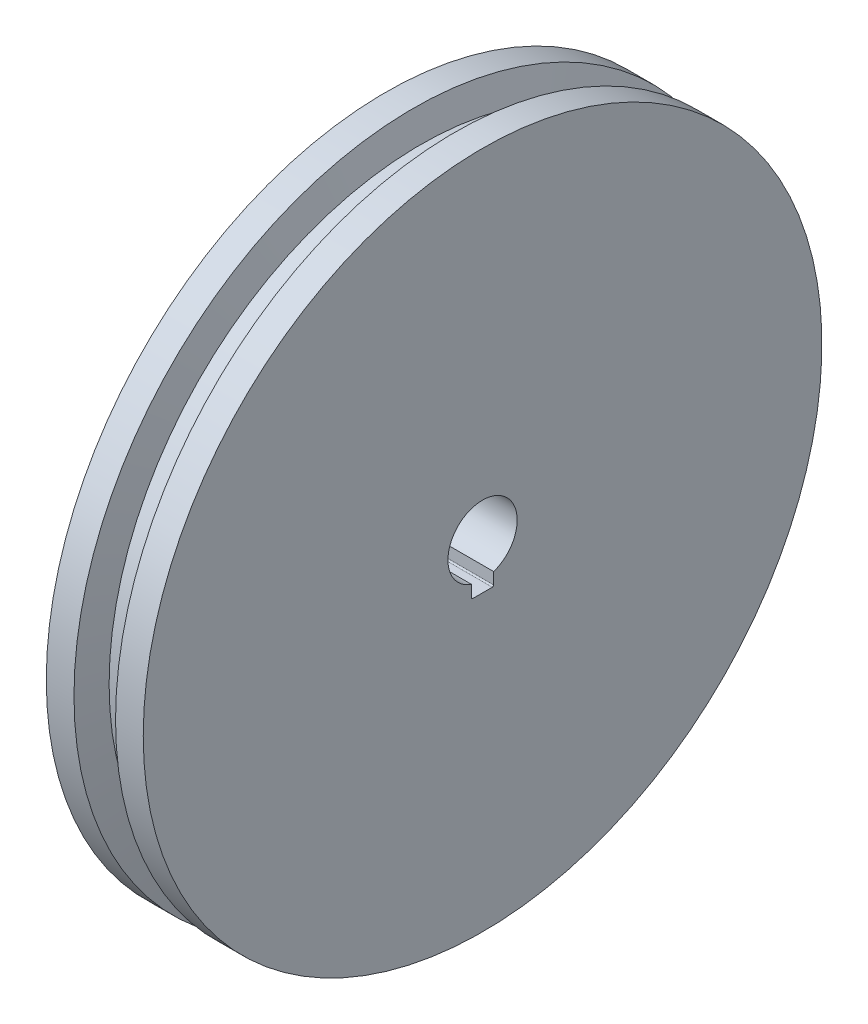
ISO-10303-21;
HEADER;
FILE_DESCRIPTION(('STEP AP214'),'2;1');
FILE_NAME('part.step','',(''),(''),'','','');
FILE_SCHEMA(('AUTOMOTIVE_DESIGN { 1 0 10303 214 1 1 1 1 }'));
ENDSEC;
DATA;
#1=APPLICATION_CONTEXT('core data for automotive mechanical design processes');
#2=APPLICATION_PROTOCOL_DEFINITION('international standard','automotive_design',2000,#1);
#3=PRODUCT_CONTEXT('',#1,'mechanical');
#4=PRODUCT('Part','Part','',(#3));
#5=PRODUCT_RELATED_PRODUCT_CATEGORY('part','',(#4));
#6=PRODUCT_DEFINITION_FORMATION('','',#4);
#7=PRODUCT_DEFINITION_CONTEXT('part definition',#1,'design');
#8=PRODUCT_DEFINITION('design','',#6,#7);
#9=PRODUCT_DEFINITION_SHAPE('','',#8);
#10=(LENGTH_UNIT() NAMED_UNIT(*) SI_UNIT(.MILLI.,.METRE.));
#11=(NAMED_UNIT(*) PLANE_ANGLE_UNIT() SI_UNIT($,.RADIAN.));
#12=(NAMED_UNIT(*) SI_UNIT($,.STERADIAN.) SOLID_ANGLE_UNIT());
#13=UNCERTAINTY_MEASURE_WITH_UNIT(LENGTH_MEASURE(1.E-05),#10,'distance_accuracy_value','');
#14=(GEOMETRIC_REPRESENTATION_CONTEXT(3) GLOBAL_UNCERTAINTY_ASSIGNED_CONTEXT((#13)) GLOBAL_UNIT_ASSIGNED_CONTEXT((#10,
#11,#12)) REPRESENTATION_CONTEXT('',''));
#15=CARTESIAN_POINT('',(0.,0.,0.));
#16=DIRECTION('',(0.,0.,1.));
#17=DIRECTION('',(1.,0.,0.));
#18=AXIS2_PLACEMENT_3D('',#15,#16,#17);
#19=CARTESIAN_POINT('',(57.3205080756888,0.,0.));
#20=DIRECTION('',(1.,0.,0.));
#21=DIRECTION('',(0.,0.,-1.));
#22=AXIS2_PLACEMENT_3D('',#19,#20,#21);
#23=CONICAL_SURFACE('',#22,112.5,1.30899693899575);
#24=CARTESIAN_POINT('',(60.,0.,0.));
#25=DIRECTION('',(-1.,0.,0.));
#26=DIRECTION('',(0.,0.,1.));
#27=AXIS2_PLACEMENT_3D('',#24,#25,#26);
#28=CIRCLE('',#27,122.5);
#29=CARTESIAN_POINT('',(60.,0.,122.5));
#30=VERTEX_POINT('',#29);
#31=EDGE_CURVE('E51',#30,#30,#28,.T.);
#32=ORIENTED_EDGE('',*,*,#31,.T.);
#33=EDGE_LOOP('',(#32));
#34=FACE_BOUND('',#33,.T.);
#35=CARTESIAN_POINT('',(57.3205080756888,0.,0.));
#36=DIRECTION('',(-1.,0.,0.));
#37=DIRECTION('',(0.,0.,1.));
#38=AXIS2_PLACEMENT_3D('',#35,#36,#37);
#39=CIRCLE('',#38,112.5);
#40=CARTESIAN_POINT('',(57.3205080756888,0.,112.5));
#41=VERTEX_POINT('',#40);
#42=EDGE_CURVE('E139',#41,#41,#39,.T.);
#43=ORIENTED_EDGE('',*,*,#42,.F.);
#44=EDGE_LOOP('',(#43));
#45=FACE_BOUND('',#44,.T.);
#46=ADVANCED_FACE('F44',(#34,#45),#23,.T.);
#47=CARTESIAN_POINT('',(0.,0.,0.));
#48=DIRECTION('',(-1.,0.,0.));
#49=DIRECTION('',(0.,0.,1.));
#50=AXIS2_PLACEMENT_3D('',#47,#48,#49);
#51=CYLINDRICAL_SURFACE('',#50,122.5);
#52=CARTESIAN_POINT('',(70.,0.,0.));
#53=DIRECTION('',(-1.,0.,0.));
#54=DIRECTION('',(0.,0.,1.));
#55=AXIS2_PLACEMENT_3D('',#52,#53,#54);
#56=CIRCLE('',#55,122.5);
#57=CARTESIAN_POINT('',(70.,0.,122.5));
#58=VERTEX_POINT('',#57);
#59=EDGE_CURVE('E173',#58,#58,#56,.T.);
#60=ORIENTED_EDGE('',*,*,#59,.T.);
#61=EDGE_LOOP('',(#60));
#62=FACE_BOUND('',#61,.T.);
#63=ORIENTED_EDGE('',*,*,#31,.F.);
#64=EDGE_LOOP('',(#63));
#65=FACE_BOUND('',#64,.T.);
#66=ADVANCED_FACE('F180',(#62,#65),#51,.T.);
#67=CARTESIAN_POINT('',(70.,-122.5,0.));
#68=DIRECTION('',(1.,0.,0.));
#69=DIRECTION('',(0.,0.,-1.));
#70=AXIS2_PLACEMENT_3D('',#67,#68,#69);
#71=PLANE('',#70);
#72=DIRECTION('',(0.,-1.,0.));
#73=VECTOR('',#72,1.);
#74=CARTESIAN_POINT('',(70.,-16.,-4.));
#75=LINE('',#74,#73);
#76=CARTESIAN_POINT('',(70.,-11.842719282327,-4.));
#77=VERTEX_POINT('',#76);
#78=CARTESIAN_POINT('',(70.,-16.,-4.));
#79=VERTEX_POINT('',#78);
#80=EDGE_CURVE('E64',#77,#79,#75,.T.);
#81=ORIENTED_EDGE('',*,*,#80,.T.);
#82=CARTESIAN_POINT('',(70.,-16.,-3.5));
#83=DIRECTION('',(-1.,0.,0.));
#84=DIRECTION('',(0.,0.,-1.));
#85=AXIS2_PLACEMENT_3D('',#82,#83,#84);
#86=CIRCLE('',#85,0.5);
#87=CARTESIAN_POINT('',(70.,-16.5,-3.49999999999999));
#88=VERTEX_POINT('',#87);
#89=EDGE_CURVE('E100',#79,#88,#86,.T.);
#90=ORIENTED_EDGE('',*,*,#89,.T.);
#91=DIRECTION('',(0.,0.,1.));
#92=VECTOR('',#91,1.);
#93=CARTESIAN_POINT('',(70.,-16.5,3.5));
#94=LINE('',#93,#92);
#95=CARTESIAN_POINT('',(70.,-16.5,3.5));
#96=VERTEX_POINT('',#95);
#97=EDGE_CURVE('E105',#88,#96,#94,.T.);
#98=ORIENTED_EDGE('',*,*,#97,.T.);
#99=CARTESIAN_POINT('',(70.,-16.,3.5));
#100=DIRECTION('',(-1.,0.,0.));
#101=DIRECTION('',(0.,0.,1.));
#102=AXIS2_PLACEMENT_3D('',#99,#100,#101);
#103=CIRCLE('',#102,0.5);
#104=CARTESIAN_POINT('',(70.,-16.,4.));
#105=VERTEX_POINT('',#104);
#106=EDGE_CURVE('E119',#96,#105,#103,.T.);
#107=ORIENTED_EDGE('',*,*,#106,.T.);
#108=DIRECTION('',(0.,1.,0.));
#109=VECTOR('',#108,1.);
#110=CARTESIAN_POINT('',(70.,-16.,4.));
#111=LINE('',#110,#109);
#112=CARTESIAN_POINT('',(70.,-11.842719282327,4.));
#113=VERTEX_POINT('',#112);
#114=EDGE_CURVE('E97',#105,#113,#111,.T.);
#115=ORIENTED_EDGE('',*,*,#114,.T.);
#116=CARTESIAN_POINT('',(70.,0.,0.));
#117=DIRECTION('',(-1.,0.,0.));
#118=DIRECTION('',(0.,0.,1.));
#119=AXIS2_PLACEMENT_3D('',#116,#117,#118);
#120=CIRCLE('',#119,12.5);
#121=EDGE_CURVE('E112',#113,#77,#120,.T.);
#122=ORIENTED_EDGE('',*,*,#121,.T.);
#123=EDGE_LOOP('',(#81,#90,#98,#107,#115,#122));
#124=FACE_BOUND('',#123,.T.);
#125=ORIENTED_EDGE('',*,*,#59,.F.);
#126=EDGE_LOOP('',(#125));
#127=FACE_BOUND('',#126,.T.);
#128=ADVANCED_FACE('F108',(#124,#127),#71,.T.);
#129=CARTESIAN_POINT('',(0.,0.,0.));
#130=DIRECTION('',(-1.,0.,0.));
#131=DIRECTION('',(0.,0.,1.));
#132=AXIS2_PLACEMENT_3D('',#129,#130,#131);
#133=CYLINDRICAL_SURFACE('',#132,12.5);
#134=DIRECTION('',(-1.,0.,0.));
#135=VECTOR('',#134,1.);
#136=CARTESIAN_POINT('',(0.,-11.842719282327,-4.));
#137=LINE('',#136,#135);
#138=CARTESIAN_POINT('',(0.,-11.842719282327,-4.));
#139=VERTEX_POINT('',#138);
#140=EDGE_CURVE('E137',#77,#139,#137,.T.);
#141=ORIENTED_EDGE('',*,*,#140,.F.);
#142=ORIENTED_EDGE('',*,*,#121,.F.);
#143=DIRECTION('',(-1.,0.,0.));
#144=VECTOR('',#143,1.);
#145=CARTESIAN_POINT('',(0.,-11.842719282327,4.));
#146=LINE('',#145,#144);
#147=CARTESIAN_POINT('',(0.,-11.842719282327,4.));
#148=VERTEX_POINT('',#147);
#149=EDGE_CURVE('E132',#148,#113,#146,.F.);
#150=ORIENTED_EDGE('',*,*,#149,.F.);
#151=CARTESIAN_POINT('',(0.,0.,0.));
#152=DIRECTION('',(-1.,0.,0.));
#153=DIRECTION('',(0.,0.,1.));
#154=AXIS2_PLACEMENT_3D('',#151,#152,#153);
#155=CIRCLE('',#154,12.5);
#156=EDGE_CURVE('E169',#148,#139,#155,.T.);
#157=ORIENTED_EDGE('',*,*,#156,.T.);
#158=EDGE_LOOP('',(#141,#142,#150,#157));
#159=FACE_BOUND('',#158,.T.);
#160=ADVANCED_FACE('F188',(#159),#133,.F.);
#161=CARTESIAN_POINT('',(0.,-30.,0.));
#162=DIRECTION('',(-1.,0.,0.));
#163=DIRECTION('',(0.,0.,1.));
#164=AXIS2_PLACEMENT_3D('',#161,#162,#163);
#165=PLANE('',#164);
#166=DIRECTION('',(0.,-1.,0.));
#167=VECTOR('',#166,1.);
#168=CARTESIAN_POINT('',(0.,-30.,-4.));
#169=LINE('',#168,#167);
#170=CARTESIAN_POINT('',(0.,-16.,-4.));
#171=VERTEX_POINT('',#170);
#172=EDGE_CURVE('E13',#139,#171,#169,.T.);
#173=ORIENTED_EDGE('',*,*,#172,.F.);
#174=ORIENTED_EDGE('',*,*,#156,.F.);
#175=DIRECTION('',(0.,1.,0.));
#176=VECTOR('',#175,1.);
#177=CARTESIAN_POINT('',(0.,-16.,4.));
#178=LINE('',#177,#176);
#179=CARTESIAN_POINT('',(0.,-16.,4.));
#180=VERTEX_POINT('',#179);
#181=EDGE_CURVE('E113',#180,#148,#178,.T.);
#182=ORIENTED_EDGE('',*,*,#181,.F.);
#183=CARTESIAN_POINT('',(0.,-16.,3.5));
#184=DIRECTION('',(-1.,0.,0.));
#185=DIRECTION('',(0.,0.,1.));
#186=AXIS2_PLACEMENT_3D('',#183,#184,#185);
#187=CIRCLE('',#186,0.5);
#188=CARTESIAN_POINT('',(0.,-16.5,3.5));
#189=VERTEX_POINT('',#188);
#190=EDGE_CURVE('E115',#189,#180,#187,.T.);
#191=ORIENTED_EDGE('',*,*,#190,.F.);
#192=DIRECTION('',(0.,0.,1.));
#193=VECTOR('',#192,1.);
#194=CARTESIAN_POINT('',(0.,-16.5,3.5));
#195=LINE('',#194,#193);
#196=CARTESIAN_POINT('',(0.,-16.5,-3.49999999999999));
#197=VERTEX_POINT('',#196);
#198=EDGE_CURVE('E125',#197,#189,#195,.T.);
#199=ORIENTED_EDGE('',*,*,#198,.F.);
#200=CARTESIAN_POINT('',(0.,-16.,-3.5));
#201=DIRECTION('',(-1.,0.,0.));
#202=DIRECTION('',(0.,0.,-1.));
#203=AXIS2_PLACEMENT_3D('',#200,#201,#202);
#204=CIRCLE('',#203,0.5);
#205=EDGE_CURVE('E123',#171,#197,#204,.T.);
#206=ORIENTED_EDGE('',*,*,#205,.F.);
#207=EDGE_LOOP('',(#173,#174,#182,#191,#199,#206));
#208=FACE_BOUND('',#207,.T.);
#209=CARTESIAN_POINT('',(0.,0.,0.));
#210=DIRECTION('',(-1.,0.,0.));
#211=DIRECTION('',(0.,0.,1.));
#212=AXIS2_PLACEMENT_3D('',#209,#210,#211);
#213=CIRCLE('',#212,30.);
#214=CARTESIAN_POINT('',(0.,0.,30.));
#215=VERTEX_POINT('',#214);
#216=EDGE_CURVE('E166',#215,#215,#213,.T.);
#217=ORIENTED_EDGE('',*,*,#216,.T.);
#218=EDGE_LOOP('',(#217));
#219=FACE_BOUND('',#218,.T.);
#220=ADVANCED_FACE('F193',(#208,#219),#165,.T.);
#221=CARTESIAN_POINT('',(0.,0.,0.));
#222=DIRECTION('',(-1.,0.,0.));
#223=DIRECTION('',(0.,0.,1.));
#224=AXIS2_PLACEMENT_3D('',#221,#222,#223);
#225=CYLINDRICAL_SURFACE('',#224,30.);
#226=CARTESIAN_POINT('',(10.,0.,0.));
#227=DIRECTION('',(-1.,0.,0.));
#228=DIRECTION('',(0.,0.,1.));
#229=AXIS2_PLACEMENT_3D('',#226,#227,#228);
#230=CIRCLE('',#229,30.);
#231=CARTESIAN_POINT('',(10.,0.,30.));
#232=VERTEX_POINT('',#231);
#233=EDGE_CURVE('E163',#232,#232,#230,.T.);
#234=ORIENTED_EDGE('',*,*,#233,.T.);
#235=EDGE_LOOP('',(#234));
#236=FACE_BOUND('',#235,.T.);
#237=ORIENTED_EDGE('',*,*,#216,.F.);
#238=EDGE_LOOP('',(#237));
#239=FACE_BOUND('',#238,.T.);
#240=ADVANCED_FACE('F197',(#236,#239),#225,.T.);
#241=CARTESIAN_POINT('',(10.,0.,0.));
#242=DIRECTION('',(-1.,0.,0.));
#243=DIRECTION('',(0.,0.,1.));
#244=AXIS2_PLACEMENT_3D('',#241,#242,#243);
#245=CONICAL_SURFACE('',#244,30.,1.30899693899575);
#246=CARTESIAN_POINT('',(12.6794919243112,0.,0.));
#247=DIRECTION('',(-1.,0.,0.));
#248=DIRECTION('',(0.,0.,1.));
#249=AXIS2_PLACEMENT_3D('',#246,#247,#248);
#250=CIRCLE('',#249,20.);
#251=CARTESIAN_POINT('',(12.6794919243112,0.,20.));
#252=VERTEX_POINT('',#251);
#253=EDGE_CURVE('E160',#252,#252,#250,.T.);
#254=ORIENTED_EDGE('',*,*,#253,.T.);
#255=EDGE_LOOP('',(#254));
#256=FACE_BOUND('',#255,.T.);
#257=ORIENTED_EDGE('',*,*,#233,.F.);
#258=EDGE_LOOP('',(#257));
#259=FACE_BOUND('',#258,.T.);
#260=ADVANCED_FACE('F201',(#256,#259),#245,.T.);
#261=CARTESIAN_POINT('',(0.,0.,0.));
#262=DIRECTION('',(-1.,0.,0.));
#263=DIRECTION('',(0.,0.,1.));
#264=AXIS2_PLACEMENT_3D('',#261,#262,#263);
#265=CYLINDRICAL_SURFACE('',#264,20.);
#266=CARTESIAN_POINT('',(22.3205080756888,0.,0.));
#267=DIRECTION('',(-1.,0.,0.));
#268=DIRECTION('',(0.,0.,1.));
#269=AXIS2_PLACEMENT_3D('',#266,#267,#268);
#270=CIRCLE('',#269,20.);
#271=CARTESIAN_POINT('',(22.3205080756888,0.,20.));
#272=VERTEX_POINT('',#271);
#273=EDGE_CURVE('E157',#272,#272,#270,.T.);
#274=ORIENTED_EDGE('',*,*,#273,.T.);
#275=EDGE_LOOP('',(#274));
#276=FACE_BOUND('',#275,.T.);
#277=ORIENTED_EDGE('',*,*,#253,.F.);
#278=EDGE_LOOP('',(#277));
#279=FACE_BOUND('',#278,.T.);
#280=ADVANCED_FACE('F205',(#276,#279),#265,.T.);
#281=CARTESIAN_POINT('',(22.3205080756888,0.,0.));
#282=DIRECTION('',(1.,0.,0.));
#283=DIRECTION('',(0.,0.,-1.));
#284=AXIS2_PLACEMENT_3D('',#281,#282,#283);
#285=CONICAL_SURFACE('',#284,20.,1.30899693899575);
#286=CARTESIAN_POINT('',(25.,0.,0.));
#287=DIRECTION('',(-1.,0.,0.));
#288=DIRECTION('',(0.,0.,1.));
#289=AXIS2_PLACEMENT_3D('',#286,#287,#288);
#290=CIRCLE('',#289,30.);
#291=CARTESIAN_POINT('',(25.,0.,30.));
#292=VERTEX_POINT('',#291);
#293=EDGE_CURVE('E154',#292,#292,#290,.T.);
#294=ORIENTED_EDGE('',*,*,#293,.T.);
#295=EDGE_LOOP('',(#294));
#296=FACE_BOUND('',#295,.T.);
#297=ORIENTED_EDGE('',*,*,#273,.F.);
#298=EDGE_LOOP('',(#297));
#299=FACE_BOUND('',#298,.T.);
#300=ADVANCED_FACE('F209',(#296,#299),#285,.T.);
#301=CARTESIAN_POINT('',(0.,0.,0.));
#302=DIRECTION('',(-1.,0.,0.));
#303=DIRECTION('',(0.,0.,1.));
#304=AXIS2_PLACEMENT_3D('',#301,#302,#303);
#305=CYLINDRICAL_SURFACE('',#304,30.);
#306=CARTESIAN_POINT('',(35.,0.,0.));
#307=DIRECTION('',(-1.,0.,0.));
#308=DIRECTION('',(0.,0.,1.));
#309=AXIS2_PLACEMENT_3D('',#306,#307,#308);
#310=CIRCLE('',#309,30.);
#311=CARTESIAN_POINT('',(35.,0.,30.));
#312=VERTEX_POINT('',#311);
#313=EDGE_CURVE('E151',#312,#312,#310,.T.);
#314=ORIENTED_EDGE('',*,*,#313,.T.);
#315=EDGE_LOOP('',(#314));
#316=FACE_BOUND('',#315,.T.);
#317=ORIENTED_EDGE('',*,*,#293,.F.);
#318=EDGE_LOOP('',(#317));
#319=FACE_BOUND('',#318,.T.);
#320=ADVANCED_FACE('F213',(#316,#319),#305,.T.);
#321=CARTESIAN_POINT('',(35.,-30.,0.));
#322=DIRECTION('',(-1.,0.,0.));
#323=DIRECTION('',(0.,0.,1.));
#324=AXIS2_PLACEMENT_3D('',#321,#322,#323);
#325=PLANE('',#324);
#326=CARTESIAN_POINT('',(35.,0.,0.));
#327=DIRECTION('',(-1.,0.,0.));
#328=DIRECTION('',(0.,0.,1.));
#329=AXIS2_PLACEMENT_3D('',#326,#327,#328);
#330=CIRCLE('',#329,122.5);
#331=CARTESIAN_POINT('',(35.,0.,122.5));
#332=VERTEX_POINT('',#331);
#333=EDGE_CURVE('E148',#332,#332,#330,.T.);
#334=ORIENTED_EDGE('',*,*,#333,.T.);
#335=EDGE_LOOP('',(#334));
#336=FACE_BOUND('',#335,.T.);
#337=ORIENTED_EDGE('',*,*,#313,.F.);
#338=EDGE_LOOP('',(#337));
#339=FACE_BOUND('',#338,.T.);
#340=ADVANCED_FACE('F217',(#336,#339),#325,.T.);
#341=CARTESIAN_POINT('',(0.,0.,0.));
#342=DIRECTION('',(-1.,0.,0.));
#343=DIRECTION('',(0.,0.,1.));
#344=AXIS2_PLACEMENT_3D('',#341,#342,#343);
#345=CYLINDRICAL_SURFACE('',#344,122.5);
#346=CARTESIAN_POINT('',(45.,0.,0.));
#347=DIRECTION('',(-1.,0.,0.));
#348=DIRECTION('',(0.,0.,1.));
#349=AXIS2_PLACEMENT_3D('',#346,#347,#348);
#350=CIRCLE('',#349,122.5);
#351=CARTESIAN_POINT('',(45.,0.,122.5));
#352=VERTEX_POINT('',#351);
#353=EDGE_CURVE('E145',#352,#352,#350,.T.);
#354=ORIENTED_EDGE('',*,*,#353,.T.);
#355=EDGE_LOOP('',(#354));
#356=FACE_BOUND('',#355,.T.);
#357=ORIENTED_EDGE('',*,*,#333,.F.);
#358=EDGE_LOOP('',(#357));
#359=FACE_BOUND('',#358,.T.);
#360=ADVANCED_FACE('F221',(#356,#359),#345,.T.);
#361=CARTESIAN_POINT('',(45.,0.,0.));
#362=DIRECTION('',(-1.,0.,0.));
#363=DIRECTION('',(0.,0.,1.));
#364=AXIS2_PLACEMENT_3D('',#361,#362,#363);
#365=CONICAL_SURFACE('',#364,122.5,1.30899693899575);
#366=CARTESIAN_POINT('',(47.6794919243112,0.,0.));
#367=DIRECTION('',(-1.,0.,0.));
#368=DIRECTION('',(0.,0.,1.));
#369=AXIS2_PLACEMENT_3D('',#366,#367,#368);
#370=CIRCLE('',#369,112.5);
#371=CARTESIAN_POINT('',(47.6794919243112,0.,112.5));
#372=VERTEX_POINT('',#371);
#373=EDGE_CURVE('E142',#372,#372,#370,.T.);
#374=ORIENTED_EDGE('',*,*,#373,.T.);
#375=EDGE_LOOP('',(#374));
#376=FACE_BOUND('',#375,.T.);
#377=ORIENTED_EDGE('',*,*,#353,.F.);
#378=EDGE_LOOP('',(#377));
#379=FACE_BOUND('',#378,.T.);
#380=ADVANCED_FACE('F225',(#376,#379),#365,.T.);
#381=CARTESIAN_POINT('',(0.,0.,0.));
#382=DIRECTION('',(-1.,0.,0.));
#383=DIRECTION('',(0.,0.,1.));
#384=AXIS2_PLACEMENT_3D('',#381,#382,#383);
#385=CYLINDRICAL_SURFACE('',#384,112.5);
#386=ORIENTED_EDGE('',*,*,#42,.T.);
#387=EDGE_LOOP('',(#386));
#388=FACE_BOUND('',#387,.T.);
#389=ORIENTED_EDGE('',*,*,#373,.F.);
#390=EDGE_LOOP('',(#389));
#391=FACE_BOUND('',#390,.T.);
#392=ADVANCED_FACE('F229',(#388,#391),#385,.T.);
#393=CARTESIAN_POINT('',(70.,-16.,-4.));
#394=DIRECTION('',(0.,0.,-1.));
#395=DIRECTION('',(-1.,0.,0.));
#396=AXIS2_PLACEMENT_3D('',#393,#394,#395);
#397=PLANE('',#396);
#398=ORIENTED_EDGE('',*,*,#140,.T.);
#399=ORIENTED_EDGE('',*,*,#172,.T.);
#400=DIRECTION('',(-1.,0.,0.));
#401=VECTOR('',#400,1.);
#402=CARTESIAN_POINT('',(70.,-16.,-4.));
#403=LINE('',#402,#401);
#404=EDGE_CURVE('E58',#79,#171,#403,.T.);
#405=ORIENTED_EDGE('',*,*,#404,.F.);
#406=ORIENTED_EDGE('',*,*,#80,.F.);
#407=EDGE_LOOP('',(#398,#399,#405,#406));
#408=FACE_BOUND('',#407,.T.);
#409=ADVANCED_FACE('F93',(#408),#397,.F.);
#410=CARTESIAN_POINT('',(70.,-16.,4.));
#411=DIRECTION('',(0.,0.,1.));
#412=DIRECTION('',(1.,0.,0.));
#413=AXIS2_PLACEMENT_3D('',#410,#411,#412);
#414=PLANE('',#413);
#415=ORIENTED_EDGE('',*,*,#149,.T.);
#416=ORIENTED_EDGE('',*,*,#114,.F.);
#417=DIRECTION('',(-1.,0.,0.));
#418=VECTOR('',#417,1.);
#419=CARTESIAN_POINT('',(70.,-16.,4.));
#420=LINE('',#419,#418);
#421=EDGE_CURVE('E130',#105,#180,#420,.T.);
#422=ORIENTED_EDGE('',*,*,#421,.T.);
#423=ORIENTED_EDGE('',*,*,#181,.T.);
#424=EDGE_LOOP('',(#415,#416,#422,#423));
#425=FACE_BOUND('',#424,.T.);
#426=ADVANCED_FACE('F236',(#425),#414,.F.);
#427=CARTESIAN_POINT('',(70.,-16.,3.5));
#428=DIRECTION('',(-1.,0.,0.));
#429=DIRECTION('',(0.,0.,1.));
#430=AXIS2_PLACEMENT_3D('',#427,#428,#429);
#431=CYLINDRICAL_SURFACE('',#430,0.5);
#432=ORIENTED_EDGE('',*,*,#190,.T.);
#433=ORIENTED_EDGE('',*,*,#421,.F.);
#434=ORIENTED_EDGE('',*,*,#106,.F.);
#435=DIRECTION('',(-1.,0.,0.));
#436=VECTOR('',#435,1.);
#437=CARTESIAN_POINT('',(70.,-16.5,3.5));
#438=LINE('',#437,#436);
#439=EDGE_CURVE('E133',#96,#189,#438,.T.);
#440=ORIENTED_EDGE('',*,*,#439,.T.);
#441=EDGE_LOOP('',(#432,#433,#434,#440));
#442=FACE_BOUND('',#441,.T.);
#443=ADVANCED_FACE('F242',(#442),#431,.F.);
#444=CARTESIAN_POINT('',(70.,-16.5,3.5));
#445=DIRECTION('',(0.,-1.,0.));
#446=DIRECTION('',(0.,0.,-1.));
#447=AXIS2_PLACEMENT_3D('',#444,#445,#446);
#448=PLANE('',#447);
#449=ORIENTED_EDGE('',*,*,#198,.T.);
#450=ORIENTED_EDGE('',*,*,#439,.F.);
#451=ORIENTED_EDGE('',*,*,#97,.F.);
#452=DIRECTION('',(-1.,0.,0.));
#453=VECTOR('',#452,1.);
#454=CARTESIAN_POINT('',(70.,-16.5,-3.49999999999999));
#455=LINE('',#454,#453);
#456=EDGE_CURVE('E96',#88,#197,#455,.T.);
#457=ORIENTED_EDGE('',*,*,#456,.T.);
#458=EDGE_LOOP('',(#449,#450,#451,#457));
#459=FACE_BOUND('',#458,.T.);
#460=ADVANCED_FACE('F239',(#459),#448,.F.);
#461=CARTESIAN_POINT('',(70.,-16.,-3.5));
#462=DIRECTION('',(-1.,0.,0.));
#463=DIRECTION('',(0.,0.,1.));
#464=AXIS2_PLACEMENT_3D('',#461,#462,#463);
#465=CYLINDRICAL_SURFACE('',#464,0.5);
#466=ORIENTED_EDGE('',*,*,#205,.T.);
#467=ORIENTED_EDGE('',*,*,#456,.F.);
#468=ORIENTED_EDGE('',*,*,#89,.F.);
#469=ORIENTED_EDGE('',*,*,#404,.T.);
#470=EDGE_LOOP('',(#466,#467,#468,#469));
#471=FACE_BOUND('',#470,.T.);
#472=ADVANCED_FACE('F101',(#471),#465,.F.);
#473=CLOSED_SHELL('',(#46,#66,#128,#160,#220,#240,#260,#280,#300,#320,#340,#360,#380,#392,#409,
#426,#443,#460,#472));
#474=MANIFOLD_SOLID_BREP('B2',#473);
#475=ADVANCED_BREP_SHAPE_REPRESENTATION('',(#18,#474),#14);
#476=SHAPE_DEFINITION_REPRESENTATION(#9,#475);
ENDSEC;
END-ISO-10303-21;
